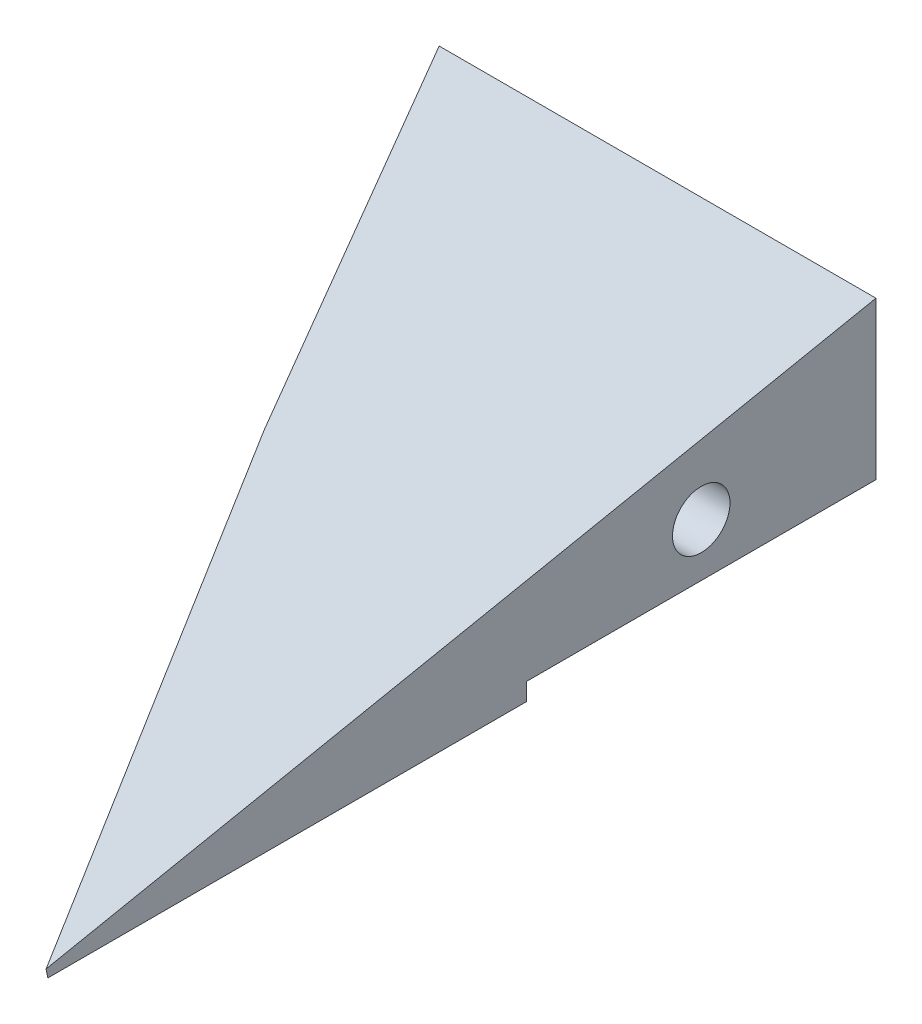
ISO-10303-21;
HEADER;
FILE_DESCRIPTION(('STEP AP214'),'2;1');
FILE_NAME('part.step','',(''),(''),'','','');
FILE_SCHEMA(('AUTOMOTIVE_DESIGN { 1 0 10303 214 1 1 1 1 }'));
ENDSEC;
DATA;
#1=APPLICATION_CONTEXT('core data for automotive mechanical design processes');
#2=APPLICATION_PROTOCOL_DEFINITION('international standard','automotive_design',2000,#1);
#3=PRODUCT_CONTEXT('',#1,'mechanical');
#4=PRODUCT('Part','Part','',(#3));
#5=PRODUCT_RELATED_PRODUCT_CATEGORY('part','',(#4));
#6=PRODUCT_DEFINITION_FORMATION('','',#4);
#7=PRODUCT_DEFINITION_CONTEXT('part definition',#1,'design');
#8=PRODUCT_DEFINITION('design','',#6,#7);
#9=PRODUCT_DEFINITION_SHAPE('','',#8);
#10=(LENGTH_UNIT() NAMED_UNIT(*) SI_UNIT(.MILLI.,.METRE.));
#11=(NAMED_UNIT(*) PLANE_ANGLE_UNIT() SI_UNIT($,.RADIAN.));
#12=(NAMED_UNIT(*) SI_UNIT($,.STERADIAN.) SOLID_ANGLE_UNIT());
#13=UNCERTAINTY_MEASURE_WITH_UNIT(LENGTH_MEASURE(1.E-05),#10,'distance_accuracy_value','');
#14=(GEOMETRIC_REPRESENTATION_CONTEXT(3) GLOBAL_UNCERTAINTY_ASSIGNED_CONTEXT((#13)) GLOBAL_UNIT_ASSIGNED_CONTEXT((#10,
#11,#12)) REPRESENTATION_CONTEXT('',''));
#15=CARTESIAN_POINT('',(0.,0.,0.));
#16=DIRECTION('',(0.,0.,1.));
#17=DIRECTION('',(1.,0.,0.));
#18=AXIS2_PLACEMENT_3D('',#15,#16,#17);
#19=CARTESIAN_POINT('',(-65.,-10.,95.));
#20=DIRECTION('',(0.,1.,0.));
#21=DIRECTION('',(0.,0.,1.));
#22=AXIS2_PLACEMENT_3D('',#19,#20,#21);
#23=PLANE('',#22);
#24=DIRECTION('',(0.,0.,-1.));
#25=VECTOR('',#24,1.);
#26=CARTESIAN_POINT('',(65.,-10.,95.));
#27=LINE('',#26,#25);
#28=CARTESIAN_POINT('',(65.,-9.99999999999999,94.8));
#29=VERTEX_POINT('',#28);
#30=CARTESIAN_POINT('',(65.,-10.,40.));
#31=VERTEX_POINT('',#30);
#32=EDGE_CURVE('E145',#29,#31,#27,.T.);
#33=ORIENTED_EDGE('',*,*,#32,.F.);
#34=DIRECTION('',(-0.464469748171317,0.,-0.885588986513311));
#35=VECTOR('',#34,1.);
#36=CARTESIAN_POINT('',(37.0370867530874,-10.,41.4840454092199));
#37=LINE('',#36,#35);
#38=CARTESIAN_POINT('',(36.2587412587413,-10.,40.));
#39=VERTEX_POINT('',#38);
#40=EDGE_CURVE('E110',#29,#39,#37,.T.);
#41=ORIENTED_EDGE('',*,*,#40,.T.);
#42=DIRECTION('',(-1.,0.,0.));
#43=VECTOR('',#42,1.);
#44=CARTESIAN_POINT('',(65.,-10.,40.));
#45=LINE('',#44,#43);
#46=EDGE_CURVE('E162',#31,#39,#45,.T.);
#47=ORIENTED_EDGE('',*,*,#46,.F.);
#48=EDGE_LOOP('',(#33,#41,#47));
#49=FACE_BOUND('',#48,.T.);
#50=ADVANCED_FACE('F39',(#49),#23,.F.);
#51=CARTESIAN_POINT('',(65.,10.,95.));
#52=DIRECTION('',(-1.,0.,0.));
#53=DIRECTION('',(0.,0.,1.));
#54=AXIS2_PLACEMENT_3D('',#51,#52,#53);
#55=PLANE('',#54);
#56=CARTESIAN_POINT('',(65.,-1.945,20.));
#57=DIRECTION('',(1.,0.,0.));
#58=DIRECTION('',(0.,0.,-1.));
#59=AXIS2_PLACEMENT_3D('',#56,#57,#58);
#60=CIRCLE('',#59,3.2899985);
#61=CARTESIAN_POINT('',(65.,-1.945,16.7100015));
#62=VERTEX_POINT('',#61);
#63=EDGE_CURVE('E136',#62,#62,#60,.T.);
#64=ORIENTED_EDGE('',*,*,#63,.F.);
#65=EDGE_LOOP('',(#64));
#66=FACE_BOUND('',#65,.T.);
#67=DIRECTION('',(0.,-0.196116135138184,0.98058067569092));
#68=VECTOR('',#67,1.);
#69=CARTESIAN_POINT('',(65.,-8.26923076923077,91.3461538461539));
#70=LINE('',#69,#68);
#71=CARTESIAN_POINT('',(65.,9.99999999999998,0.));
#72=VERTEX_POINT('',#71);
#73=CARTESIAN_POINT('',(65.,-9.00000000000001,95.));
#74=VERTEX_POINT('',#73);
#75=EDGE_CURVE('E121',#72,#74,#70,.T.);
#76=ORIENTED_EDGE('',*,*,#75,.T.);
#77=DIRECTION('',(0.,0.98058067569092,0.196116135138184));
#78=VECTOR('',#77,1.);
#79=CARTESIAN_POINT('',(65.,-28.2307692307692,91.1538461538462));
#80=LINE('',#79,#78);
#81=EDGE_CURVE('E104',#29,#74,#80,.T.);
#82=ORIENTED_EDGE('',*,*,#81,.F.);
#83=ORIENTED_EDGE('',*,*,#32,.T.);
#84=DIRECTION('',(0.,-1.,0.));
#85=VECTOR('',#84,1.);
#86=CARTESIAN_POINT('',(65.,-10.,40.));
#87=LINE('',#86,#85);
#88=CARTESIAN_POINT('',(65.,-8.,40.));
#89=VERTEX_POINT('',#88);
#90=EDGE_CURVE('E173',#89,#31,#87,.T.);
#91=ORIENTED_EDGE('',*,*,#90,.F.);
#92=DIRECTION('',(0.,0.,-1.));
#93=VECTOR('',#92,1.);
#94=CARTESIAN_POINT('',(65.,-8.,40.));
#95=LINE('',#94,#93);
#96=CARTESIAN_POINT('',(65.,-8.,0.));
#97=VERTEX_POINT('',#96);
#98=EDGE_CURVE('E165',#89,#97,#95,.T.);
#99=ORIENTED_EDGE('',*,*,#98,.T.);
#100=DIRECTION('',(0.,1.,0.));
#101=VECTOR('',#100,1.);
#102=CARTESIAN_POINT('',(65.,10.,0.));
#103=LINE('',#102,#101);
#104=EDGE_CURVE('E128',#97,#72,#103,.T.);
#105=ORIENTED_EDGE('',*,*,#104,.T.);
#106=EDGE_LOOP('',(#76,#82,#83,#91,#99,#105));
#107=FACE_BOUND('',#106,.T.);
#108=ADVANCED_FACE('F41',(#66,#107),#55,.F.);
#109=CARTESIAN_POINT('',(0.,0.,0.));
#110=DIRECTION('',(0.,0.,1.));
#111=DIRECTION('',(1.,0.,0.));
#112=AXIS2_PLACEMENT_3D('',#109,#110,#111);
#113=PLANE('',#112);
#114=ORIENTED_EDGE('',*,*,#104,.F.);
#115=DIRECTION('',(1.,0.,0.));
#116=VECTOR('',#115,1.);
#117=CARTESIAN_POINT('',(65.,-8.,0.));
#118=LINE('',#117,#116);
#119=CARTESIAN_POINT('',(15.,-8.,0.));
#120=VERTEX_POINT('',#119);
#121=EDGE_CURVE('E177',#120,#97,#118,.T.);
#122=ORIENTED_EDGE('',*,*,#121,.F.);
#123=DIRECTION('',(0.,1.,0.));
#124=VECTOR('',#123,1.);
#125=CARTESIAN_POINT('',(15.,-10.001,0.));
#126=LINE('',#125,#124);
#127=CARTESIAN_POINT('',(15.,10.,0.));
#128=VERTEX_POINT('',#127);
#129=EDGE_CURVE('E63',#120,#128,#126,.T.);
#130=ORIENTED_EDGE('',*,*,#129,.T.);
#131=DIRECTION('',(-1.,0.,0.));
#132=VECTOR('',#131,1.);
#133=CARTESIAN_POINT('',(-65.,10.,0.));
#134=LINE('',#133,#132);
#135=EDGE_CURVE('E142',#72,#128,#134,.T.);
#136=ORIENTED_EDGE('',*,*,#135,.F.);
#137=EDGE_LOOP('',(#114,#122,#130,#136));
#138=FACE_BOUND('',#137,.T.);
#139=ADVANCED_FACE('F194',(#138),#113,.F.);
#140=CARTESIAN_POINT('',(35.,-10.001,40.));
#141=DIRECTION('',(0.894427190999916,0.,-0.447213595499958));
#142=DIRECTION('',(-0.447213595499958,0.,-0.894427190999916));
#143=AXIS2_PLACEMENT_3D('',#140,#141,#142);
#144=PLANE('',#143);
#145=CARTESIAN_POINT('',(23.9442719099992,-1.945,17.8885438199983));
#146=DIRECTION('',(-0.894427190999916,0.,0.447213595499958));
#147=DIRECTION('',(0.447213595499958,0.,0.894427190999916));
#148=AXIS2_PLACEMENT_3D('',#145,#146,#147);
#149=CIRCLE('',#148,3.28999849999999);
#150=CARTESIAN_POINT('',(25.4156039683736,-1.945,20.8312079367473));
#151=VERTEX_POINT('',#150);
#152=EDGE_CURVE('E171',#151,#151,#149,.T.);
#153=ORIENTED_EDGE('',*,*,#152,.F.);
#154=EDGE_LOOP('',(#153));
#155=FACE_BOUND('',#154,.T.);
#156=DIRECTION('',(0.447213595499958,0.,0.894427190999916));
#157=VECTOR('',#156,1.);
#158=CARTESIAN_POINT('',(35.,-8.,40.));
#159=LINE('',#158,#157);
#160=CARTESIAN_POINT('',(34.3377053396747,-8.,38.6754106793494));
#161=VERTEX_POINT('',#160);
#162=EDGE_CURVE('E150',#120,#161,#159,.T.);
#163=ORIENTED_EDGE('',*,*,#162,.T.);
#164=DIRECTION('',(0.0655149351975286,0.98921128497926,0.131029870395057));
#165=VECTOR('',#164,1.);
#166=CARTESIAN_POINT('',(34.2222378331018,-9.74344613493015,38.4444756662036));
#167=LINE('',#166,#165);
#168=CARTESIAN_POINT('',(35.,1.99999999999998,40.));
#169=VERTEX_POINT('',#168);
#170=EDGE_CURVE('E179',#161,#169,#167,.T.);
#171=ORIENTED_EDGE('',*,*,#170,.T.);
#172=DIRECTION('',(-0.440225453162812,0.176090181265125,-0.880450906325624));
#173=VECTOR('',#172,1.);
#174=CARTESIAN_POINT('',(35.9303100775194,1.62787596899224,41.8606201550388));
#175=LINE('',#174,#173);
#176=EDGE_CURVE('E123',#169,#128,#175,.T.);
#177=ORIENTED_EDGE('',*,*,#176,.T.);
#178=ORIENTED_EDGE('',*,*,#129,.F.);
#179=EDGE_LOOP('',(#163,#171,#177,#178));
#180=FACE_BOUND('',#179,.T.);
#181=ADVANCED_FACE('F199',(#155,#180),#144,.F.);
#182=CARTESIAN_POINT('',(282.658902631417,10.0000000000001,0.));
#183=DIRECTION('',(0.,-0.98058067569092,-0.196116135138184));
#184=DIRECTION('',(0.,0.196116135138184,-0.98058067569092));
#185=AXIS2_PLACEMENT_3D('',#182,#183,#184);
#186=PLANE('',#185);
#187=ORIENTED_EDGE('',*,*,#176,.F.);
#188=DIRECTION('',(-0.471637485727808,0.172933744766863,-0.864668723834314));
#189=VECTOR('',#188,1.);
#190=CARTESIAN_POINT('',(35.,1.99999999999998,40.));
#191=LINE('',#190,#189);
#192=EDGE_CURVE('E107',#74,#169,#191,.T.);
#193=ORIENTED_EDGE('',*,*,#192,.F.);
#194=ORIENTED_EDGE('',*,*,#75,.F.);
#195=ORIENTED_EDGE('',*,*,#135,.T.);
#196=EDGE_LOOP('',(#187,#193,#194,#195));
#197=FACE_BOUND('',#196,.T.);
#198=ADVANCED_FACE('F120',(#197),#186,.F.);
#199=CARTESIAN_POINT('',(55.,-1.945,20.));
#200=DIRECTION('',(1.,0.,0.));
#201=DIRECTION('',(0.,0.,-1.));
#202=AXIS2_PLACEMENT_3D('',#199,#200,#201);
#203=CONICAL_SURFACE('',#202,3.2899985,1.02974425867665);
#204=CARTESIAN_POINT('',(53.0231694646903,-1.945,20.));
#205=VERTEX_POINT('',#204);
#206=VERTEX_LOOP('',#205);
#207=FACE_BOUND('',#206,.T.);
#208=CARTESIAN_POINT('',(55.,-1.945,20.));
#209=DIRECTION('',(1.,0.,0.));
#210=DIRECTION('',(0.,0.,-1.));
#211=AXIS2_PLACEMENT_3D('',#208,#209,#210);
#212=CIRCLE('',#211,3.2899985);
#213=CARTESIAN_POINT('',(55.,-1.945,16.7100015));
#214=VERTEX_POINT('',#213);
#215=EDGE_CURVE('E130',#214,#214,#212,.T.);
#216=ORIENTED_EDGE('',*,*,#215,.T.);
#217=EDGE_LOOP('',(#216));
#218=FACE_BOUND('',#217,.T.);
#219=ADVANCED_FACE('F210',(#207,#218),#203,.F.);
#220=CARTESIAN_POINT('',(65.,-1.945,20.));
#221=DIRECTION('',(1.,0.,0.));
#222=DIRECTION('',(0.,0.,-1.));
#223=AXIS2_PLACEMENT_3D('',#220,#221,#222);
#224=CYLINDRICAL_SURFACE('',#223,3.2899985);
#225=ORIENTED_EDGE('',*,*,#215,.F.);
#226=EDGE_LOOP('',(#225));
#227=FACE_BOUND('',#226,.T.);
#228=ORIENTED_EDGE('',*,*,#63,.T.);
#229=EDGE_LOOP('',(#228));
#230=FACE_BOUND('',#229,.T.);
#231=ADVANCED_FACE('F191',(#227,#230),#224,.F.);
#232=CARTESIAN_POINT('',(32.8885438199983,-1.945,13.4164078649987));
#233=DIRECTION('',(-0.894427190999916,0.,0.447213595499958));
#234=DIRECTION('',(0.447213595499958,0.,0.894427190999916));
#235=AXIS2_PLACEMENT_3D('',#232,#233,#234);
#236=CONICAL_SURFACE('',#235,3.28999849999999,1.02974425867665);
#237=CARTESIAN_POINT('',(34.6566748027783,-1.945,12.5323423736088));
#238=VERTEX_POINT('',#237);
#239=VERTEX_LOOP('',#238);
#240=FACE_BOUND('',#239,.T.);
#241=CARTESIAN_POINT('',(32.8885438199983,-1.945,13.4164078649987));
#242=DIRECTION('',(-0.894427190999916,0.,0.447213595499958));
#243=DIRECTION('',(0.447213595499958,0.,0.894427190999916));
#244=AXIS2_PLACEMENT_3D('',#241,#242,#243);
#245=CIRCLE('',#244,3.28999849999999);
#246=CARTESIAN_POINT('',(34.3598758783728,-1.945,16.3590719817477));
#247=VERTEX_POINT('',#246);
#248=EDGE_CURVE('E184',#247,#247,#245,.T.);
#249=ORIENTED_EDGE('',*,*,#248,.T.);
#250=EDGE_LOOP('',(#249));
#251=FACE_BOUND('',#250,.T.);
#252=ADVANCED_FACE('F216',(#240,#251),#236,.F.);
#253=CARTESIAN_POINT('',(23.9442719099992,-1.945,17.8885438199983));
#254=DIRECTION('',(-0.894427190999916,0.,0.447213595499958));
#255=DIRECTION('',(0.447213595499958,0.,0.894427190999916));
#256=AXIS2_PLACEMENT_3D('',#253,#254,#255);
#257=CYLINDRICAL_SURFACE('',#256,3.28999849999999);
#258=ORIENTED_EDGE('',*,*,#248,.F.);
#259=EDGE_LOOP('',(#258));
#260=FACE_BOUND('',#259,.T.);
#261=ORIENTED_EDGE('',*,*,#152,.T.);
#262=EDGE_LOOP('',(#261));
#263=FACE_BOUND('',#262,.T.);
#264=ADVANCED_FACE('F220',(#260,#263),#257,.F.);
#265=CARTESIAN_POINT('',(65.,-8.,40.));
#266=DIRECTION('',(0.,1.,0.));
#267=DIRECTION('',(0.,0.,1.));
#268=AXIS2_PLACEMENT_3D('',#265,#266,#267);
#269=PLANE('',#268);
#270=DIRECTION('',(-0.464469748171317,0.,-0.885588986513311));
#271=VECTOR('',#270,1.);
#272=CARTESIAN_POINT('',(42.2946229960881,-8.,51.9084145125412));
#273=LINE('',#272,#271);
#274=CARTESIAN_POINT('',(36.048951048951,-8.,40.));
#275=VERTEX_POINT('',#274);
#276=CARTESIAN_POINT('',(35.,-8.,38.));
#277=VERTEX_POINT('',#276);
#278=EDGE_CURVE('E55',#275,#277,#273,.T.);
#279=ORIENTED_EDGE('',*,*,#278,.T.);
#280=DIRECTION('',(-0.700140042013998,0.,0.714005547295424));
#281=VECTOR('',#280,1.);
#282=CARTESIAN_POINT('',(48.7060746051776,-8.,24.0224916266879));
#283=LINE('',#282,#281);
#284=EDGE_CURVE('E11',#277,#161,#283,.T.);
#285=ORIENTED_EDGE('',*,*,#284,.T.);
#286=ORIENTED_EDGE('',*,*,#162,.F.);
#287=ORIENTED_EDGE('',*,*,#121,.T.);
#288=ORIENTED_EDGE('',*,*,#98,.F.);
#289=DIRECTION('',(1.,0.,0.));
#290=VECTOR('',#289,1.);
#291=CARTESIAN_POINT('',(65.,-8.,40.));
#292=LINE('',#291,#290);
#293=EDGE_CURVE('E159',#275,#89,#292,.T.);
#294=ORIENTED_EDGE('',*,*,#293,.F.);
#295=EDGE_LOOP('',(#279,#285,#286,#287,#288,#294));
#296=FACE_BOUND('',#295,.T.);
#297=ADVANCED_FACE('F164',(#296),#269,.F.);
#298=CARTESIAN_POINT('',(0.,0.,40.));
#299=DIRECTION('',(0.,0.,1.));
#300=DIRECTION('',(1.,0.,0.));
#301=AXIS2_PLACEMENT_3D('',#298,#299,#300);
#302=PLANE('',#301);
#303=ORIENTED_EDGE('',*,*,#46,.T.);
#304=DIRECTION('',(-0.104322744313672,0.994543495790337,0.));
#305=VECTOR('',#304,1.);
#306=CARTESIAN_POINT('',(34.8265937893006,3.6531392086679,40.));
#307=LINE('',#306,#305);
#308=EDGE_CURVE('E48',#39,#275,#307,.T.);
#309=ORIENTED_EDGE('',*,*,#308,.T.);
#310=ORIENTED_EDGE('',*,*,#293,.T.);
#311=ORIENTED_EDGE('',*,*,#90,.T.);
#312=EDGE_LOOP('',(#303,#309,#310,#311));
#313=FACE_BOUND('',#312,.T.);
#314=ADVANCED_FACE('F157',(#313),#302,.F.);
#315=CARTESIAN_POINT('',(35.,-17.2307692307692,36.1538461538462));
#316=DIRECTION('',(-0.707106781186555,0.138675049056306,-0.693375245281529));
#317=DIRECTION('',(-0.700140042013998,0.,0.714005547295424));
#318=AXIS2_PLACEMENT_3D('',#315,#316,#317);
#319=PLANE('',#318);
#320=ORIENTED_EDGE('',*,*,#284,.F.);
#321=DIRECTION('',(0.,0.98058067569092,0.196116135138184));
#322=VECTOR('',#321,1.);
#323=CARTESIAN_POINT('',(35.,-17.2307692307692,36.1538461538462));
#324=LINE('',#323,#322);
#325=EDGE_CURVE('E115',#277,#169,#324,.T.);
#326=ORIENTED_EDGE('',*,*,#325,.T.);
#327=ORIENTED_EDGE('',*,*,#170,.F.);
#328=EDGE_LOOP('',(#320,#326,#327));
#329=FACE_BOUND('',#328,.T.);
#330=ADVANCED_FACE('F229',(#329),#319,.F.);
#331=CARTESIAN_POINT('',(35.,-17.2307692307692,36.1538461538462));
#332=DIRECTION('',(0.881792539124908,0.0924957208872283,-0.46247860443614));
#333=DIRECTION('',(-0.464469748171317,0.,-0.885588986513311));
#334=AXIS2_PLACEMENT_3D('',#331,#332,#333);
#335=PLANE('',#334);
#336=ORIENTED_EDGE('',*,*,#81,.T.);
#337=ORIENTED_EDGE('',*,*,#192,.T.);
#338=ORIENTED_EDGE('',*,*,#325,.F.);
#339=ORIENTED_EDGE('',*,*,#278,.F.);
#340=ORIENTED_EDGE('',*,*,#308,.F.);
#341=ORIENTED_EDGE('',*,*,#40,.F.);
#342=EDGE_LOOP('',(#336,#337,#338,#339,#340,#341));
#343=FACE_BOUND('',#342,.T.);
#344=ADVANCED_FACE('F106',(#343),#335,.F.);
#345=CLOSED_SHELL('',(#50,#108,#139,#181,#198,#219,#231,#252,#264,#297,#314,#330,#344));
#346=MANIFOLD_SOLID_BREP('B2',#345);
#347=ADVANCED_BREP_SHAPE_REPRESENTATION('',(#18,#346),#14);
#348=SHAPE_DEFINITION_REPRESENTATION(#9,#347);
ENDSEC;
END-ISO-10303-21;
